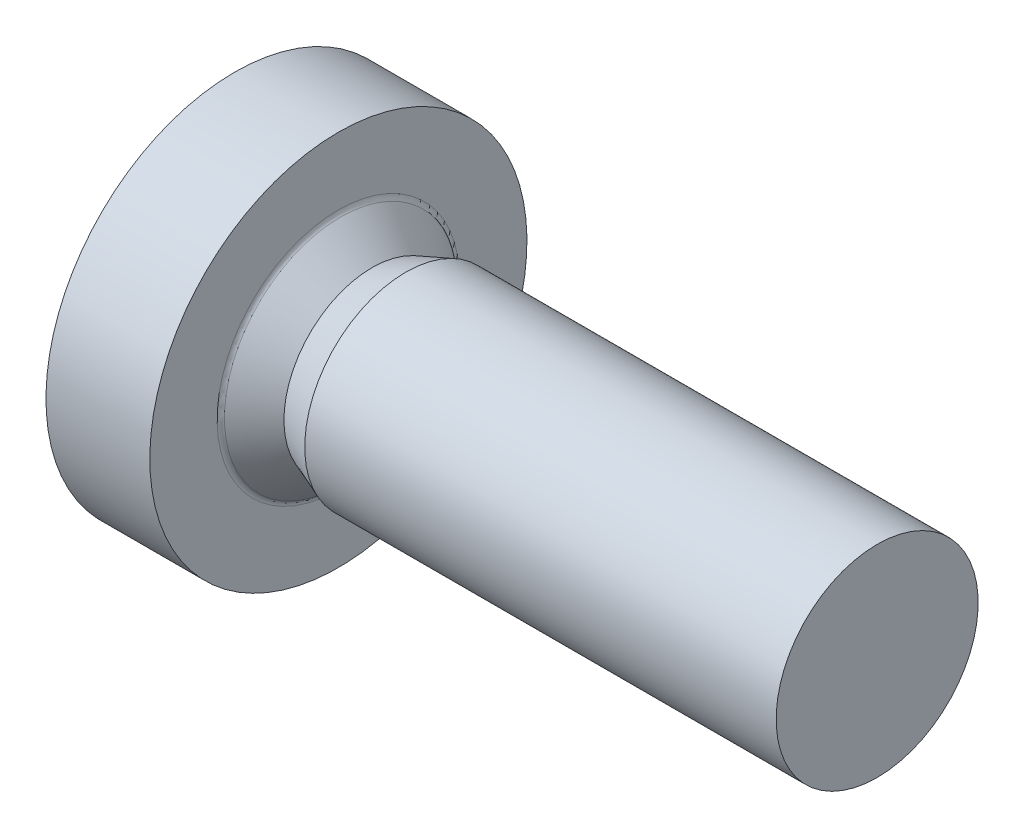
ISO-10303-21;
HEADER;
FILE_DESCRIPTION(('STEP AP214'),'2;1');
FILE_NAME('part.step','',(''),(''),'','','');
FILE_SCHEMA(('AUTOMOTIVE_DESIGN { 1 0 10303 214 1 1 1 1 }'));
ENDSEC;
DATA;
#1=APPLICATION_CONTEXT('core data for automotive mechanical design processes');
#2=APPLICATION_PROTOCOL_DEFINITION('international standard','automotive_design',2000,#1);
#3=PRODUCT_CONTEXT('',#1,'mechanical');
#4=PRODUCT('Part','Part','',(#3));
#5=PRODUCT_RELATED_PRODUCT_CATEGORY('part','',(#4));
#6=PRODUCT_DEFINITION_FORMATION('','',#4);
#7=PRODUCT_DEFINITION_CONTEXT('part definition',#1,'design');
#8=PRODUCT_DEFINITION('design','',#6,#7);
#9=PRODUCT_DEFINITION_SHAPE('','',#8);
#10=(LENGTH_UNIT() NAMED_UNIT(*) SI_UNIT(.MILLI.,.METRE.));
#11=(NAMED_UNIT(*) PLANE_ANGLE_UNIT() SI_UNIT($,.RADIAN.));
#12=(NAMED_UNIT(*) SI_UNIT($,.STERADIAN.) SOLID_ANGLE_UNIT());
#13=UNCERTAINTY_MEASURE_WITH_UNIT(LENGTH_MEASURE(1.E-05),#10,'distance_accuracy_value','');
#14=(GEOMETRIC_REPRESENTATION_CONTEXT(3) GLOBAL_UNCERTAINTY_ASSIGNED_CONTEXT((#13)) GLOBAL_UNIT_ASSIGNED_CONTEXT((#10,
#11,#12)) REPRESENTATION_CONTEXT('',''));
#15=CARTESIAN_POINT('',(0.,0.,0.));
#16=DIRECTION('',(0.,0.,1.));
#17=DIRECTION('',(1.,0.,0.));
#18=AXIS2_PLACEMENT_3D('',#15,#16,#17);
#19=CARTESIAN_POINT('',(8.,0.75,0.));
#20=DIRECTION('',(1.,0.,0.));
#21=DIRECTION('',(0.,1.,0.));
#22=AXIS2_PLACEMENT_3D('',#19,#20,#21);
#23=PLANE('',#22);
#24=CARTESIAN_POINT('',(8.,0.,0.));
#25=DIRECTION('',(1.,0.,0.));
#26=DIRECTION('',(0.,1.,0.));
#27=AXIS2_PLACEMENT_3D('',#24,#25,#26);
#28=CIRCLE('',#27,1.5);
#29=CARTESIAN_POINT('',(8.,1.5,0.));
#30=VERTEX_POINT('',#29);
#31=EDGE_CURVE('E11',#30,#30,#28,.T.);
#32=ORIENTED_EDGE('',*,*,#31,.T.);
#33=EDGE_LOOP('',(#32));
#34=FACE_BOUND('',#33,.T.);
#35=ADVANCED_FACE('F19',(#34),#23,.T.);
#36=CARTESIAN_POINT('',(4.5,0.,0.));
#37=DIRECTION('',(-1.,0.,0.));
#38=DIRECTION('',(0.,1.,0.));
#39=AXIS2_PLACEMENT_3D('',#36,#37,#38);
#40=CYLINDRICAL_SURFACE('',#39,1.5);
#41=CARTESIAN_POINT('',(1.,0.,0.));
#42=DIRECTION('',(1.,0.,0.));
#43=DIRECTION('',(0.,1.,0.));
#44=AXIS2_PLACEMENT_3D('',#41,#42,#43);
#45=CIRCLE('',#44,1.5);
#46=CARTESIAN_POINT('',(1.,1.5,0.));
#47=VERTEX_POINT('',#46);
#48=EDGE_CURVE('E29',#47,#47,#45,.T.);
#49=ORIENTED_EDGE('',*,*,#48,.T.);
#50=EDGE_LOOP('',(#49));
#51=FACE_BOUND('',#50,.T.);
#52=ORIENTED_EDGE('',*,*,#31,.F.);
#53=EDGE_LOOP('',(#52));
#54=FACE_BOUND('',#53,.T.);
#55=ADVANCED_FACE('F431',(#51,#54),#40,.T.);
#56=CARTESIAN_POINT('',(0.75,0.,0.));
#57=DIRECTION('',(1.,0.,0.));
#58=DIRECTION('',(0.,1.,0.));
#59=AXIS2_PLACEMENT_3D('',#56,#57,#58);
#60=CONICAL_SURFACE('',#59,1.404375,0.365329745380517);
#61=CARTESIAN_POINT('',(0.5,0.,0.));
#62=DIRECTION('',(1.,0.,0.));
#63=DIRECTION('',(0.,1.,0.));
#64=AXIS2_PLACEMENT_3D('',#61,#62,#63);
#65=CIRCLE('',#64,1.30875);
#66=CARTESIAN_POINT('',(0.5,1.30875,0.));
#67=VERTEX_POINT('',#66);
#68=EDGE_CURVE('E311',#67,#67,#65,.T.);
#69=ORIENTED_EDGE('',*,*,#68,.T.);
#70=EDGE_LOOP('',(#69));
#71=FACE_BOUND('',#70,.T.);
#72=ORIENTED_EDGE('',*,*,#48,.F.);
#73=EDGE_LOOP('',(#72));
#74=FACE_BOUND('',#73,.T.);
#75=ADVANCED_FACE('F436',(#71,#74),#60,.T.);
#76=CARTESIAN_POINT('',(0.266697090928547,0.,0.));
#77=DIRECTION('',(-1.,0.,0.));
#78=DIRECTION('',(0.,1.,0.));
#79=AXIS2_PLACEMENT_3D('',#76,#77,#78);
#80=CONICAL_SURFACE('',#79,1.51708001042528,0.728911585355214);
#81=CARTESIAN_POINT('',(0.0333941818570946,0.,0.));
#82=DIRECTION('',(1.,0.,0.));
#83=DIRECTION('',(0.,1.,0.));
#84=AXIS2_PLACEMENT_3D('',#81,#82,#83);
#85=CIRCLE('',#84,1.72541002085056);
#86=CARTESIAN_POINT('',(0.0333941818570951,1.72541002085056,0.));
#87=VERTEX_POINT('',#86);
#88=EDGE_CURVE('E313',#87,#87,#85,.T.);
#89=ORIENTED_EDGE('',*,*,#88,.T.);
#90=EDGE_LOOP('',(#89));
#91=FACE_BOUND('',#90,.T.);
#92=ORIENTED_EDGE('',*,*,#68,.F.);
#93=EDGE_LOOP('',(#92));
#94=FACE_BOUND('',#93,.T.);
#95=ADVANCED_FACE('F448',(#91,#94),#80,.T.);
#96=CARTESIAN_POINT('',(0.1,0.,0.));
#97=DIRECTION('',(1.,0.,0.));
#98=DIRECTION('',(0.,0.,-1.));
#99=AXIS2_PLACEMENT_3D('',#96,#97,#98);
#100=TOROIDAL_SURFACE('',#99,1.8,0.1);
#101=CARTESIAN_POINT('',(0.,0.,0.));
#102=DIRECTION('',(1.,0.,0.));
#103=DIRECTION('',(0.,1.,0.));
#104=AXIS2_PLACEMENT_3D('',#101,#102,#103);
#105=CIRCLE('',#104,1.8);
#106=CARTESIAN_POINT('',(0.,1.8,0.));
#107=VERTEX_POINT('',#106);
#108=EDGE_CURVE('E261',#107,#107,#105,.T.);
#109=ORIENTED_EDGE('',*,*,#108,.T.);
#110=EDGE_LOOP('',(#109));
#111=FACE_BOUND('',#110,.T.);
#112=ORIENTED_EDGE('',*,*,#88,.F.);
#113=EDGE_LOOP('',(#112));
#114=FACE_BOUND('',#113,.T.);
#115=ADVANCED_FACE('F444',(#111,#114),#100,.F.);
#116=CARTESIAN_POINT('',(0.,2.3,0.));
#117=DIRECTION('',(1.,0.,0.));
#118=DIRECTION('',(0.,1.,0.));
#119=AXIS2_PLACEMENT_3D('',#116,#117,#118);
#120=PLANE('',#119);
#121=CARTESIAN_POINT('',(0.,0.,0.));
#122=DIRECTION('',(1.,0.,0.));
#123=DIRECTION('',(0.,1.,0.));
#124=AXIS2_PLACEMENT_3D('',#121,#122,#123);
#125=CIRCLE('',#124,2.8);
#126=CARTESIAN_POINT('',(0.,2.8,0.));
#127=VERTEX_POINT('',#126);
#128=EDGE_CURVE('E257',#127,#127,#125,.T.);
#129=ORIENTED_EDGE('',*,*,#128,.T.);
#130=EDGE_LOOP('',(#129));
#131=FACE_BOUND('',#130,.T.);
#132=ORIENTED_EDGE('',*,*,#108,.F.);
#133=EDGE_LOOP('',(#132));
#134=FACE_BOUND('',#133,.T.);
#135=ADVANCED_FACE('F447',(#131,#134),#120,.T.);
#136=CARTESIAN_POINT('',(-0.771231517720798,0.,0.));
#137=DIRECTION('',(-1.,0.,0.));
#138=DIRECTION('',(0.,1.,0.));
#139=AXIS2_PLACEMENT_3D('',#136,#137,#138);
#140=CYLINDRICAL_SURFACE('',#139,2.8);
#141=CARTESIAN_POINT('',(-1.54246303544159,0.,0.));
#142=DIRECTION('',(1.,0.,0.));
#143=DIRECTION('',(0.,1.,0.));
#144=AXIS2_PLACEMENT_3D('',#141,#142,#143);
#145=CIRCLE('',#144,2.8);
#146=CARTESIAN_POINT('',(-1.54246303544159,2.8,0.));
#147=VERTEX_POINT('',#146);
#148=EDGE_CURVE('E255',#147,#147,#145,.T.);
#149=ORIENTED_EDGE('',*,*,#148,.T.);
#150=EDGE_LOOP('',(#149));
#151=FACE_BOUND('',#150,.T.);
#152=ORIENTED_EDGE('',*,*,#128,.F.);
#153=EDGE_LOOP('',(#152));
#154=FACE_BOUND('',#153,.T.);
#155=ADVANCED_FACE('F461',(#151,#154),#140,.T.);
#156=CARTESIAN_POINT('',(2.6,0.,0.));
#157=DIRECTION('',(0.,0.,1.));
#158=DIRECTION('',(1.,0.,0.));
#159=AXIS2_PLACEMENT_3D('',#156,#157,#158);
#160=SPHERICAL_SURFACE('',#159,5.);
#161=ORIENTED_EDGE('',*,*,#148,.F.);
#162=EDGE_LOOP('',(#161));
#163=FACE_BOUND('',#162,.T.);
#164=CARTESIAN_POINT('',(2.6,1.5,0.));
#165=DIRECTION('',(0.,1.,0.));
#166=DIRECTION('',(0.,0.,-1.));
#167=AXIS2_PLACEMENT_3D('',#164,#165,#166);
#168=CIRCLE('',#167,4.76969600708473);
#169=CARTESIAN_POINT('',(-2.16025209416476,1.5,-0.3));
#170=VERTEX_POINT('',#169);
#171=CARTESIAN_POINT('',(-2.16025209416476,1.5,0.3));
#172=VERTEX_POINT('',#171);
#173=EDGE_CURVE('E289',#170,#172,#168,.T.);
#174=ORIENTED_EDGE('',*,*,#173,.T.);
#175=CARTESIAN_POINT('',(2.6,-0.0146530414091956,0.167485029701634));
#176=DIRECTION('',(0.,-0.0871557427476582,0.996194698091746));
#177=DIRECTION('',(0.,0.996194698091746,0.0871557427476581));
#178=AXIS2_PLACEMENT_3D('',#175,#176,#177);
#179=CIRCLE('',#178,4.99717260590459);
#180=CARTESIAN_POINT('',(-2.35893576512593,0.6,0.221260202826669));
#181=VERTEX_POINT('',#180);
#182=EDGE_CURVE('E226',#172,#181,#179,.T.);
#183=ORIENTED_EDGE('',*,*,#182,.T.);
#184=CARTESIAN_POINT('',(2.6,0.245808478247197,0.425752773255334));
#185=DIRECTION('',(0.,0.5,0.866025403784438));
#186=DIRECTION('',(0.,0.866025403784438,-0.5));
#187=AXIS2_PLACEMENT_3D('',#184,#185,#186);
#188=CIRCLE('',#187,4.97577258002083);
#189=CARTESIAN_POINT('',(-2.374028589137,0.359888590016273,0.359888590016274));
#190=VERTEX_POINT('',#189);
#191=EDGE_CURVE('E285',#181,#190,#188,.T.);
#192=ORIENTED_EDGE('',*,*,#191,.T.);
#193=CARTESIAN_POINT('',(2.6,0.425752773255333,0.245808478247197));
#194=DIRECTION('',(0.,0.866025403784439,0.5));
#195=DIRECTION('',(0.,0.5,-0.866025403784439));
#196=AXIS2_PLACEMENT_3D('',#193,#194,#195);
#197=CIRCLE('',#196,4.97577258002083);
#198=CARTESIAN_POINT('',(-2.35893576512593,0.221260202826669,0.6));
#199=VERTEX_POINT('',#198);
#200=EDGE_CURVE('E224',#190,#199,#197,.T.);
#201=ORIENTED_EDGE('',*,*,#200,.T.);
#202=CARTESIAN_POINT('',(2.6,0.167485029701634,-0.0146530414091956));
#203=DIRECTION('',(0.,0.996194698091746,-0.0871557427476583));
#204=DIRECTION('',(0.,-0.0871557427476583,-0.996194698091746));
#205=AXIS2_PLACEMENT_3D('',#202,#203,#204);
#206=CIRCLE('',#205,4.99717260590459);
#207=CARTESIAN_POINT('',(-2.16025209416476,0.3,1.5));
#208=VERTEX_POINT('',#207);
#209=EDGE_CURVE('E246',#199,#208,#206,.T.);
#210=ORIENTED_EDGE('',*,*,#209,.T.);
#211=CARTESIAN_POINT('',(2.6,0.,1.5));
#212=DIRECTION('',(0.,0.,1.));
#213=DIRECTION('',(0.,1.,0.));
#214=AXIS2_PLACEMENT_3D('',#211,#212,#213);
#215=CIRCLE('',#214,4.76969600708473);
#216=CARTESIAN_POINT('',(-2.16025209416476,-0.3,1.5));
#217=VERTEX_POINT('',#216);
#218=EDGE_CURVE('E242',#208,#217,#215,.T.);
#219=ORIENTED_EDGE('',*,*,#218,.T.);
#220=CARTESIAN_POINT('',(2.6,-0.167485029701634,-0.0146530414091956));
#221=DIRECTION('',(0.,-0.996194698091746,-0.0871557427476581));
#222=DIRECTION('',(0.,-0.0871557427476581,0.996194698091746));
#223=AXIS2_PLACEMENT_3D('',#220,#221,#222);
#224=CIRCLE('',#223,4.99717260590459);
#225=CARTESIAN_POINT('',(-2.35893576512593,-0.221260202826669,0.6));
#226=VERTEX_POINT('',#225);
#227=EDGE_CURVE('E189',#217,#226,#224,.T.);
#228=ORIENTED_EDGE('',*,*,#227,.T.);
#229=CARTESIAN_POINT('',(2.6,-0.425752773255333,0.245808478247197));
#230=DIRECTION('',(0.,-0.866025403784439,0.5));
#231=DIRECTION('',(0.,0.5,0.866025403784439));
#232=AXIS2_PLACEMENT_3D('',#229,#230,#231);
#233=CIRCLE('',#232,4.97577258002083);
#234=CARTESIAN_POINT('',(-2.374028589137,-0.359888590016273,0.359888590016274));
#235=VERTEX_POINT('',#234);
#236=EDGE_CURVE('E199',#226,#235,#233,.T.);
#237=ORIENTED_EDGE('',*,*,#236,.T.);
#238=CARTESIAN_POINT('',(2.6,-0.245808478247197,0.425752773255334));
#239=DIRECTION('',(0.,-0.5,0.866025403784439));
#240=DIRECTION('',(0.,0.866025403784439,0.5));
#241=AXIS2_PLACEMENT_3D('',#238,#239,#240);
#242=CIRCLE('',#241,4.97577258002083);
#243=CARTESIAN_POINT('',(-2.35893576512593,-0.6,0.221260202826669));
#244=VERTEX_POINT('',#243);
#245=EDGE_CURVE('E202',#235,#244,#242,.T.);
#246=ORIENTED_EDGE('',*,*,#245,.T.);
#247=CARTESIAN_POINT('',(2.6,0.0146530414091956,0.167485029701634));
#248=DIRECTION('',(0.,0.0871557427476581,0.996194698091746));
#249=DIRECTION('',(0.,0.996194698091746,-0.0871557427476581));
#250=AXIS2_PLACEMENT_3D('',#247,#248,#249);
#251=CIRCLE('',#250,4.99717260590459);
#252=CARTESIAN_POINT('',(-2.16025209416476,-1.5,0.3));
#253=VERTEX_POINT('',#252);
#254=EDGE_CURVE('E275',#244,#253,#251,.T.);
#255=ORIENTED_EDGE('',*,*,#254,.T.);
#256=CARTESIAN_POINT('',(2.6,-1.5,0.));
#257=DIRECTION('',(0.,-1.,0.));
#258=DIRECTION('',(0.,0.,1.));
#259=AXIS2_PLACEMENT_3D('',#256,#257,#258);
#260=CIRCLE('',#259,4.76969600708473);
#261=CARTESIAN_POINT('',(-2.16025209416476,-1.5,-0.3));
#262=VERTEX_POINT('',#261);
#263=EDGE_CURVE('E310',#253,#262,#260,.T.);
#264=ORIENTED_EDGE('',*,*,#263,.T.);
#265=CARTESIAN_POINT('',(2.6,0.0146530414091956,-0.167485029701634));
#266=DIRECTION('',(0.,0.087155742747658,-0.996194698091746));
#267=DIRECTION('',(0.,-0.996194698091746,-0.087155742747658));
#268=AXIS2_PLACEMENT_3D('',#265,#266,#267);
#269=CIRCLE('',#268,4.99717260590459);
#270=CARTESIAN_POINT('',(-2.35893576512593,-0.6,-0.221260202826669));
#271=VERTEX_POINT('',#270);
#272=EDGE_CURVE('E209',#262,#271,#269,.T.);
#273=ORIENTED_EDGE('',*,*,#272,.T.);
#274=CARTESIAN_POINT('',(2.6,-0.245808478247196,-0.425752773255333));
#275=DIRECTION('',(0.,-0.5,-0.866025403784439));
#276=DIRECTION('',(0.,-0.866025403784439,0.5));
#277=AXIS2_PLACEMENT_3D('',#274,#275,#276);
#278=CIRCLE('',#277,4.97577258002083);
#279=CARTESIAN_POINT('',(-2.374028589137,-0.359888590016273,-0.359888590016273));
#280=VERTEX_POINT('',#279);
#281=EDGE_CURVE('E236',#271,#280,#278,.T.);
#282=ORIENTED_EDGE('',*,*,#281,.T.);
#283=CARTESIAN_POINT('',(2.6,-0.425752773255333,-0.245808478247196));
#284=DIRECTION('',(0.,-0.866025403784439,-0.5));
#285=DIRECTION('',(0.,-0.5,0.866025403784439));
#286=AXIS2_PLACEMENT_3D('',#283,#284,#285);
#287=CIRCLE('',#286,4.97577258002083);
#288=CARTESIAN_POINT('',(-2.35893576512593,-0.221260202826669,-0.6));
#289=VERTEX_POINT('',#288);
#290=EDGE_CURVE('E269',#280,#289,#287,.T.);
#291=ORIENTED_EDGE('',*,*,#290,.T.);
#292=CARTESIAN_POINT('',(2.6,-0.167485029701634,0.0146530414091956));
#293=DIRECTION('',(0.,-0.996194698091746,0.0871557427476582));
#294=DIRECTION('',(0.,0.0871557427476582,0.996194698091746));
#295=AXIS2_PLACEMENT_3D('',#292,#293,#294);
#296=CIRCLE('',#295,4.99717260590459);
#297=CARTESIAN_POINT('',(-2.16025209416476,-0.3,-1.5));
#298=VERTEX_POINT('',#297);
#299=EDGE_CURVE('E253',#289,#298,#296,.T.);
#300=ORIENTED_EDGE('',*,*,#299,.T.);
#301=CARTESIAN_POINT('',(2.6,0.,-1.5));
#302=DIRECTION('',(0.,0.,-1.));
#303=DIRECTION('',(0.,-1.,0.));
#304=AXIS2_PLACEMENT_3D('',#301,#302,#303);
#305=CIRCLE('',#304,4.76969600708473);
#306=CARTESIAN_POINT('',(-2.16025209416476,0.3,-1.5));
#307=VERTEX_POINT('',#306);
#308=EDGE_CURVE('E321',#298,#307,#305,.T.);
#309=ORIENTED_EDGE('',*,*,#308,.T.);
#310=CARTESIAN_POINT('',(2.6,0.167485029701634,0.0146530414091956));
#311=DIRECTION('',(0.,0.996194698091746,0.0871557427476582));
#312=DIRECTION('',(0.,0.0871557427476582,-0.996194698091746));
#313=AXIS2_PLACEMENT_3D('',#310,#311,#312);
#314=CIRCLE('',#313,4.99717260590459);
#315=CARTESIAN_POINT('',(-2.35893576512593,0.221260202826669,-0.6));
#316=VERTEX_POINT('',#315);
#317=EDGE_CURVE('E214',#307,#316,#314,.T.);
#318=ORIENTED_EDGE('',*,*,#317,.T.);
#319=CARTESIAN_POINT('',(2.6,0.425752773255333,-0.245808478247196));
#320=DIRECTION('',(0.,0.866025403784439,-0.5));
#321=DIRECTION('',(0.,-0.5,-0.866025403784439));
#322=AXIS2_PLACEMENT_3D('',#319,#320,#321);
#323=CIRCLE('',#322,4.97577258002083);
#324=CARTESIAN_POINT('',(-2.374028589137,0.359888590016273,-0.359888590016274));
#325=VERTEX_POINT('',#324);
#326=EDGE_CURVE('E109',#316,#325,#323,.T.);
#327=ORIENTED_EDGE('',*,*,#326,.T.);
#328=CARTESIAN_POINT('',(2.6,0.245808478247196,-0.425752773255333));
#329=DIRECTION('',(0.,0.5,-0.866025403784439));
#330=DIRECTION('',(0.,-0.866025403784439,-0.5));
#331=AXIS2_PLACEMENT_3D('',#328,#329,#330);
#332=CIRCLE('',#331,4.97577258002083);
#333=CARTESIAN_POINT('',(-2.35893576512593,0.6,-0.221260202826669));
#334=VERTEX_POINT('',#333);
#335=EDGE_CURVE('E207',#325,#334,#332,.T.);
#336=ORIENTED_EDGE('',*,*,#335,.T.);
#337=CARTESIAN_POINT('',(2.6,-0.0146530414091956,-0.167485029701633));
#338=DIRECTION('',(0.,-0.0871557427476582,-0.996194698091746));
#339=DIRECTION('',(0.,-0.996194698091746,0.0871557427476582));
#340=AXIS2_PLACEMENT_3D('',#337,#338,#339);
#341=CIRCLE('',#340,4.99717260590459);
#342=EDGE_CURVE('E304',#334,#170,#341,.T.);
#343=ORIENTED_EDGE('',*,*,#342,.T.);
#344=EDGE_LOOP('',(#174,#183,#192,#201,#210,#219,#228,#237,#246,#255,#264,#273,#282,#291,#300,
#309,#318,#327,#336,#343));
#345=FACE_BOUND('',#344,.T.);
#346=ADVANCED_FACE('F352',(#163,#345),#160,.T.);
#347=CARTESIAN_POINT('',(-1.2,0.,0.));
#348=DIRECTION('',(1.,0.,0.));
#349=DIRECTION('',(0.,0.,-1.));
#350=AXIS2_PLACEMENT_3D('',#347,#348,#349);
#351=PLANE('',#350);
#352=DIRECTION('',(0.,0.,-1.));
#353=VECTOR('',#352,1.);
#354=CARTESIAN_POINT('',(-1.2,1.5,-0.3));
#355=LINE('',#354,#353);
#356=CARTESIAN_POINT('',(-1.2,1.5,0.3));
#357=VERTEX_POINT('',#356);
#358=CARTESIAN_POINT('',(-1.2,1.5,-0.3));
#359=VERTEX_POINT('',#358);
#360=EDGE_CURVE('E276',#357,#359,#355,.T.);
#361=ORIENTED_EDGE('',*,*,#360,.T.);
#362=DIRECTION('',(0.,-0.996194698091746,0.0871557427476582));
#363=VECTOR('',#362,1.);
#364=CARTESIAN_POINT('',(-1.2,1.5,-0.3));
#365=LINE('',#364,#363);
#366=CARTESIAN_POINT('',(-1.2,0.6,-0.221260202826669));
#367=VERTEX_POINT('',#366);
#368=EDGE_CURVE('E293',#359,#367,#365,.T.);
#369=ORIENTED_EDGE('',*,*,#368,.T.);
#370=DIRECTION('',(0.,-0.866025403784439,-0.5));
#371=VECTOR('',#370,1.);
#372=CARTESIAN_POINT('',(-1.2,0.6,-0.221260202826669));
#373=LINE('',#372,#371);
#374=CARTESIAN_POINT('',(-1.2,0.359888590016273,-0.359888590016273));
#375=VERTEX_POINT('',#374);
#376=EDGE_CURVE('E305',#367,#375,#373,.T.);
#377=ORIENTED_EDGE('',*,*,#376,.T.);
#378=DIRECTION('',(0.,-0.5,-0.866025403784439));
#379=VECTOR('',#378,1.);
#380=CARTESIAN_POINT('',(-1.2,0.221260202826669,-0.6));
#381=LINE('',#380,#379);
#382=CARTESIAN_POINT('',(-1.2,0.221260202826669,-0.6));
#383=VERTEX_POINT('',#382);
#384=EDGE_CURVE('E99',#375,#383,#381,.T.);
#385=ORIENTED_EDGE('',*,*,#384,.T.);
#386=DIRECTION('',(0.,0.0871557427476582,-0.996194698091746));
#387=VECTOR('',#386,1.);
#388=CARTESIAN_POINT('',(-1.2,0.3,-1.5));
#389=LINE('',#388,#387);
#390=CARTESIAN_POINT('',(-1.2,0.3,-1.5));
#391=VERTEX_POINT('',#390);
#392=EDGE_CURVE('E217',#383,#391,#389,.T.);
#393=ORIENTED_EDGE('',*,*,#392,.T.);
#394=DIRECTION('',(0.,-1.,0.));
#395=VECTOR('',#394,1.);
#396=CARTESIAN_POINT('',(-1.2,-0.3,-1.5));
#397=LINE('',#396,#395);
#398=CARTESIAN_POINT('',(-1.2,-0.3,-1.5));
#399=VERTEX_POINT('',#398);
#400=EDGE_CURVE('E232',#391,#399,#397,.T.);
#401=ORIENTED_EDGE('',*,*,#400,.T.);
#402=DIRECTION('',(0.,0.0871557427476582,0.996194698091746));
#403=VECTOR('',#402,1.);
#404=CARTESIAN_POINT('',(-1.2,-0.3,-1.5));
#405=LINE('',#404,#403);
#406=CARTESIAN_POINT('',(-1.2,-0.221260202826669,-0.6));
#407=VERTEX_POINT('',#406);
#408=EDGE_CURVE('E297',#399,#407,#405,.T.);
#409=ORIENTED_EDGE('',*,*,#408,.T.);
#410=DIRECTION('',(0.,-0.5,0.866025403784439));
#411=VECTOR('',#410,1.);
#412=CARTESIAN_POINT('',(-1.2,-0.221260202826669,-0.6));
#413=LINE('',#412,#411);
#414=CARTESIAN_POINT('',(-1.2,-0.359888590016273,-0.359888590016273));
#415=VERTEX_POINT('',#414);
#416=EDGE_CURVE('E254',#407,#415,#413,.T.);
#417=ORIENTED_EDGE('',*,*,#416,.T.);
#418=DIRECTION('',(0.,-0.866025403784439,0.5));
#419=VECTOR('',#418,1.);
#420=CARTESIAN_POINT('',(-1.2,-0.6,-0.221260202826669));
#421=LINE('',#420,#419);
#422=CARTESIAN_POINT('',(-1.2,-0.6,-0.221260202826669));
#423=VERTEX_POINT('',#422);
#424=EDGE_CURVE('E270',#415,#423,#421,.T.);
#425=ORIENTED_EDGE('',*,*,#424,.T.);
#426=DIRECTION('',(0.,-0.996194698091746,-0.087155742747658));
#427=VECTOR('',#426,1.);
#428=CARTESIAN_POINT('',(-1.2,-1.5,-0.3));
#429=LINE('',#428,#427);
#430=CARTESIAN_POINT('',(-1.2,-1.5,-0.3));
#431=VERTEX_POINT('',#430);
#432=EDGE_CURVE('E212',#423,#431,#429,.T.);
#433=ORIENTED_EDGE('',*,*,#432,.T.);
#434=DIRECTION('',(0.,0.,1.));
#435=VECTOR('',#434,1.);
#436=CARTESIAN_POINT('',(-1.2,-1.5,0.3));
#437=LINE('',#436,#435);
#438=CARTESIAN_POINT('',(-1.2,-1.5,0.3));
#439=VERTEX_POINT('',#438);
#440=EDGE_CURVE('E309',#431,#439,#437,.T.);
#441=ORIENTED_EDGE('',*,*,#440,.T.);
#442=DIRECTION('',(0.,0.996194698091746,-0.0871557427476581));
#443=VECTOR('',#442,1.);
#444=CARTESIAN_POINT('',(-1.2,-1.5,0.3));
#445=LINE('',#444,#443);
#446=CARTESIAN_POINT('',(-1.2,-0.6,0.221260202826669));
#447=VERTEX_POINT('',#446);
#448=EDGE_CURVE('E195',#439,#447,#445,.T.);
#449=ORIENTED_EDGE('',*,*,#448,.T.);
#450=DIRECTION('',(0.,0.866025403784439,0.5));
#451=VECTOR('',#450,1.);
#452=CARTESIAN_POINT('',(-1.2,-0.6,0.221260202826669));
#453=LINE('',#452,#451);
#454=CARTESIAN_POINT('',(-1.2,-0.359888590016273,0.359888590016274));
#455=VERTEX_POINT('',#454);
#456=EDGE_CURVE('E192',#447,#455,#453,.T.);
#457=ORIENTED_EDGE('',*,*,#456,.T.);
#458=DIRECTION('',(0.,0.5,0.866025403784439));
#459=VECTOR('',#458,1.);
#460=CARTESIAN_POINT('',(-1.2,-0.221260202826669,0.6));
#461=LINE('',#460,#459);
#462=CARTESIAN_POINT('',(-1.2,-0.221260202826669,0.6));
#463=VERTEX_POINT('',#462);
#464=EDGE_CURVE('E179',#455,#463,#461,.T.);
#465=ORIENTED_EDGE('',*,*,#464,.T.);
#466=DIRECTION('',(0.,-0.0871557427476581,0.996194698091746));
#467=VECTOR('',#466,1.);
#468=CARTESIAN_POINT('',(-1.2,-0.3,1.5));
#469=LINE('',#468,#467);
#470=CARTESIAN_POINT('',(-1.2,-0.3,1.5));
#471=VERTEX_POINT('',#470);
#472=EDGE_CURVE('E240',#463,#471,#469,.T.);
#473=ORIENTED_EDGE('',*,*,#472,.T.);
#474=DIRECTION('',(0.,1.,0.));
#475=VECTOR('',#474,1.);
#476=CARTESIAN_POINT('',(-1.2,0.3,1.5));
#477=LINE('',#476,#475);
#478=CARTESIAN_POINT('',(-1.2,0.3,1.5));
#479=VERTEX_POINT('',#478);
#480=EDGE_CURVE('E243',#471,#479,#477,.T.);
#481=ORIENTED_EDGE('',*,*,#480,.T.);
#482=DIRECTION('',(0.,-0.0871557427476583,-0.996194698091746));
#483=VECTOR('',#482,1.);
#484=CARTESIAN_POINT('',(-1.2,0.3,1.5));
#485=LINE('',#484,#483);
#486=CARTESIAN_POINT('',(-1.2,0.221260202826669,0.6));
#487=VERTEX_POINT('',#486);
#488=EDGE_CURVE('E221',#479,#487,#485,.T.);
#489=ORIENTED_EDGE('',*,*,#488,.T.);
#490=DIRECTION('',(0.,0.5,-0.866025403784439));
#491=VECTOR('',#490,1.);
#492=CARTESIAN_POINT('',(-1.2,0.221260202826669,0.6));
#493=LINE('',#492,#491);
#494=CARTESIAN_POINT('',(-1.2,0.359888590016273,0.359888590016274));
#495=VERTEX_POINT('',#494);
#496=EDGE_CURVE('E294',#487,#495,#493,.T.);
#497=ORIENTED_EDGE('',*,*,#496,.T.);
#498=DIRECTION('',(0.,0.866025403784438,-0.5));
#499=VECTOR('',#498,1.);
#500=CARTESIAN_POINT('',(-1.2,0.6,0.221260202826669));
#501=LINE('',#500,#499);
#502=CARTESIAN_POINT('',(-1.2,0.6,0.221260202826669));
#503=VERTEX_POINT('',#502);
#504=EDGE_CURVE('E229',#495,#503,#501,.T.);
#505=ORIENTED_EDGE('',*,*,#504,.T.);
#506=DIRECTION('',(0.,0.996194698091746,0.0871557427476582));
#507=VECTOR('',#506,1.);
#508=CARTESIAN_POINT('',(-1.2,1.5,0.3));
#509=LINE('',#508,#507);
#510=EDGE_CURVE('E228',#503,#357,#509,.T.);
#511=ORIENTED_EDGE('',*,*,#510,.T.);
#512=EDGE_LOOP('',(#361,#369,#377,#385,#393,#401,#409,#417,#425,#433,#441,#449,#457,#465,#473,
#481,#489,#497,#505,#511));
#513=FACE_BOUND('',#512,.T.);
#514=ADVANCED_FACE('F193',(#513),#351,.F.);
#515=CARTESIAN_POINT('',(-2.64,1.05,0.260630101413334));
#516=DIRECTION('',(0.,-0.0871557427476581,0.996194698091746));
#517=DIRECTION('',(0.,-0.996194698091746,-0.0871557427476582));
#518=AXIS2_PLACEMENT_3D('',#515,#516,#517);
#519=PLANE('',#518);
#520=ORIENTED_EDGE('',*,*,#182,.F.);
#521=DIRECTION('',(1.,0.,0.));
#522=VECTOR('',#521,1.);
#523=CARTESIAN_POINT('',(-2.64,1.5,0.3));
#524=LINE('',#523,#522);
#525=EDGE_CURVE('E272',#172,#357,#524,.T.);
#526=ORIENTED_EDGE('',*,*,#525,.T.);
#527=ORIENTED_EDGE('',*,*,#510,.F.);
#528=DIRECTION('',(1.,0.,0.));
#529=VECTOR('',#528,1.);
#530=CARTESIAN_POINT('',(-2.64,0.6,0.221260202826669));
#531=LINE('',#530,#529);
#532=EDGE_CURVE('E265',#181,#503,#531,.T.);
#533=ORIENTED_EDGE('',*,*,#532,.F.);
#534=EDGE_LOOP('',(#520,#526,#527,#533));
#535=FACE_BOUND('',#534,.T.);
#536=ADVANCED_FACE('F418',(#535),#519,.F.);
#537=CARTESIAN_POINT('',(-2.64,0.479944295008137,0.290574396421471));
#538=DIRECTION('',(0.,0.5,0.866025403784438));
#539=DIRECTION('',(0.,-0.866025403784438,0.5));
#540=AXIS2_PLACEMENT_3D('',#537,#538,#539);
#541=PLANE('',#540);
#542=ORIENTED_EDGE('',*,*,#191,.F.);
#543=ORIENTED_EDGE('',*,*,#532,.T.);
#544=ORIENTED_EDGE('',*,*,#504,.F.);
#545=DIRECTION('',(1.,0.,0.));
#546=VECTOR('',#545,1.);
#547=CARTESIAN_POINT('',(-2.64,0.359888590016273,0.359888590016273));
#548=LINE('',#547,#546);
#549=EDGE_CURVE('E249',#190,#495,#548,.T.);
#550=ORIENTED_EDGE('',*,*,#549,.F.);
#551=EDGE_LOOP('',(#542,#543,#544,#550));
#552=FACE_BOUND('',#551,.T.);
#553=ADVANCED_FACE('F419',(#552),#541,.F.);
#554=CARTESIAN_POINT('',(-2.64,0.290574396421471,0.479944295008137));
#555=DIRECTION('',(0.,0.866025403784439,0.5));
#556=DIRECTION('',(0.,-0.5,0.866025403784439));
#557=AXIS2_PLACEMENT_3D('',#554,#555,#556);
#558=PLANE('',#557);
#559=ORIENTED_EDGE('',*,*,#200,.F.);
#560=ORIENTED_EDGE('',*,*,#549,.T.);
#561=ORIENTED_EDGE('',*,*,#496,.F.);
#562=DIRECTION('',(1.,0.,0.));
#563=VECTOR('',#562,1.);
#564=CARTESIAN_POINT('',(-2.64,0.221260202826669,0.6));
#565=LINE('',#564,#563);
#566=EDGE_CURVE('E225',#199,#487,#565,.T.);
#567=ORIENTED_EDGE('',*,*,#566,.F.);
#568=EDGE_LOOP('',(#559,#560,#561,#567));
#569=FACE_BOUND('',#568,.T.);
#570=ADVANCED_FACE('F402',(#569),#558,.F.);
#571=CARTESIAN_POINT('',(-2.64,0.260630101413335,1.05));
#572=DIRECTION('',(0.,0.996194698091746,-0.0871557427476583));
#573=DIRECTION('',(0.,0.0871557427476583,0.996194698091746));
#574=AXIS2_PLACEMENT_3D('',#571,#572,#573);
#575=PLANE('',#574);
#576=ORIENTED_EDGE('',*,*,#209,.F.);
#577=ORIENTED_EDGE('',*,*,#566,.T.);
#578=ORIENTED_EDGE('',*,*,#488,.F.);
#579=DIRECTION('',(1.,0.,0.));
#580=VECTOR('',#579,1.);
#581=CARTESIAN_POINT('',(-2.64,0.3,1.5));
#582=LINE('',#581,#580);
#583=EDGE_CURVE('E247',#208,#479,#582,.T.);
#584=ORIENTED_EDGE('',*,*,#583,.F.);
#585=EDGE_LOOP('',(#576,#577,#578,#584));
#586=FACE_BOUND('',#585,.T.);
#587=ADVANCED_FACE('F397',(#586),#575,.F.);
#588=CARTESIAN_POINT('',(-2.64,0.,1.5));
#589=DIRECTION('',(0.,0.,1.));
#590=DIRECTION('',(0.,-1.,0.));
#591=AXIS2_PLACEMENT_3D('',#588,#589,#590);
#592=PLANE('',#591);
#593=ORIENTED_EDGE('',*,*,#218,.F.);
#594=ORIENTED_EDGE('',*,*,#583,.T.);
#595=ORIENTED_EDGE('',*,*,#480,.F.);
#596=DIRECTION('',(1.,0.,0.));
#597=VECTOR('',#596,1.);
#598=CARTESIAN_POINT('',(-2.64,-0.3,1.5));
#599=LINE('',#598,#597);
#600=EDGE_CURVE('E220',#217,#471,#599,.T.);
#601=ORIENTED_EDGE('',*,*,#600,.F.);
#602=EDGE_LOOP('',(#593,#594,#595,#601));
#603=FACE_BOUND('',#602,.T.);
#604=ADVANCED_FACE('F21',(#603),#592,.F.);
#605=CARTESIAN_POINT('',(-2.64,-0.260630101413334,1.05));
#606=DIRECTION('',(0.,-0.996194698091746,-0.0871557427476581));
#607=DIRECTION('',(0.,0.0871557427476581,-0.996194698091746));
#608=AXIS2_PLACEMENT_3D('',#605,#606,#607);
#609=PLANE('',#608);
#610=ORIENTED_EDGE('',*,*,#227,.F.);
#611=ORIENTED_EDGE('',*,*,#600,.T.);
#612=ORIENTED_EDGE('',*,*,#472,.F.);
#613=DIRECTION('',(1.,0.,0.));
#614=VECTOR('',#613,1.);
#615=CARTESIAN_POINT('',(-2.64,-0.221260202826669,0.6));
#616=LINE('',#615,#614);
#617=EDGE_CURVE('E187',#226,#463,#616,.T.);
#618=ORIENTED_EDGE('',*,*,#617,.F.);
#619=EDGE_LOOP('',(#610,#611,#612,#618));
#620=FACE_BOUND('',#619,.T.);
#621=ADVANCED_FACE('F394',(#620),#609,.F.);
#622=CARTESIAN_POINT('',(-2.64,-0.290574396421471,0.479944295008137));
#623=DIRECTION('',(0.,-0.866025403784439,0.5));
#624=DIRECTION('',(0.,-0.5,-0.866025403784439));
#625=AXIS2_PLACEMENT_3D('',#622,#623,#624);
#626=PLANE('',#625);
#627=ORIENTED_EDGE('',*,*,#236,.F.);
#628=ORIENTED_EDGE('',*,*,#617,.T.);
#629=ORIENTED_EDGE('',*,*,#464,.F.);
#630=DIRECTION('',(1.,0.,0.));
#631=VECTOR('',#630,1.);
#632=CARTESIAN_POINT('',(-2.64,-0.359888590016273,0.359888590016274));
#633=LINE('',#632,#631);
#634=EDGE_CURVE('E184',#235,#455,#633,.T.);
#635=ORIENTED_EDGE('',*,*,#634,.F.);
#636=EDGE_LOOP('',(#627,#628,#629,#635));
#637=FACE_BOUND('',#636,.T.);
#638=ADVANCED_FACE('F182',(#637),#626,.F.);
#639=CARTESIAN_POINT('',(-2.64,-0.479944295008137,0.290574396421471));
#640=DIRECTION('',(0.,-0.5,0.866025403784439));
#641=DIRECTION('',(0.,-0.866025403784439,-0.5));
#642=AXIS2_PLACEMENT_3D('',#639,#640,#641);
#643=PLANE('',#642);
#644=ORIENTED_EDGE('',*,*,#245,.F.);
#645=ORIENTED_EDGE('',*,*,#634,.T.);
#646=ORIENTED_EDGE('',*,*,#456,.F.);
#647=DIRECTION('',(1.,0.,0.));
#648=VECTOR('',#647,1.);
#649=CARTESIAN_POINT('',(-2.64,-0.6,0.221260202826669));
#650=LINE('',#649,#648);
#651=EDGE_CURVE('E23',#244,#447,#650,.T.);
#652=ORIENTED_EDGE('',*,*,#651,.F.);
#653=EDGE_LOOP('',(#644,#645,#646,#652));
#654=FACE_BOUND('',#653,.T.);
#655=ADVANCED_FACE('F201',(#654),#643,.F.);
#656=CARTESIAN_POINT('',(-2.64,-1.05,0.260630101413335));
#657=DIRECTION('',(0.,0.0871557427476581,0.996194698091746));
#658=DIRECTION('',(0.,-0.996194698091746,0.0871557427476581));
#659=AXIS2_PLACEMENT_3D('',#656,#657,#658);
#660=PLANE('',#659);
#661=ORIENTED_EDGE('',*,*,#254,.F.);
#662=ORIENTED_EDGE('',*,*,#651,.T.);
#663=ORIENTED_EDGE('',*,*,#448,.F.);
#664=DIRECTION('',(1.,0.,0.));
#665=VECTOR('',#664,1.);
#666=CARTESIAN_POINT('',(-2.64,-1.5,0.3));
#667=LINE('',#666,#665);
#668=EDGE_CURVE('E306',#253,#439,#667,.T.);
#669=ORIENTED_EDGE('',*,*,#668,.F.);
#670=EDGE_LOOP('',(#661,#662,#663,#669));
#671=FACE_BOUND('',#670,.T.);
#672=ADVANCED_FACE('F389',(#671),#660,.F.);
#673=CARTESIAN_POINT('',(-2.64,1.5,0.));
#674=DIRECTION('',(0.,1.,0.));
#675=DIRECTION('',(0.,0.,1.));
#676=AXIS2_PLACEMENT_3D('',#673,#674,#675);
#677=PLANE('',#676);
#678=ORIENTED_EDGE('',*,*,#173,.F.);
#679=DIRECTION('',(1.,0.,0.));
#680=VECTOR('',#679,1.);
#681=CARTESIAN_POINT('',(-2.64,1.5,-0.3));
#682=LINE('',#681,#680);
#683=EDGE_CURVE('E290',#170,#359,#682,.T.);
#684=ORIENTED_EDGE('',*,*,#683,.T.);
#685=ORIENTED_EDGE('',*,*,#360,.F.);
#686=ORIENTED_EDGE('',*,*,#525,.F.);
#687=EDGE_LOOP('',(#678,#684,#685,#686));
#688=FACE_BOUND('',#687,.T.);
#689=ADVANCED_FACE('F412',(#688),#677,.F.);
#690=CARTESIAN_POINT('',(-2.64,1.05,-0.260630101413335));
#691=DIRECTION('',(0.,-0.0871557427476582,-0.996194698091746));
#692=DIRECTION('',(0.,0.996194698091746,-0.0871557427476582));
#693=AXIS2_PLACEMENT_3D('',#690,#691,#692);
#694=PLANE('',#693);
#695=ORIENTED_EDGE('',*,*,#342,.F.);
#696=DIRECTION('',(1.,0.,0.));
#697=VECTOR('',#696,1.);
#698=CARTESIAN_POINT('',(-2.64,0.6,-0.221260202826669));
#699=LINE('',#698,#697);
#700=EDGE_CURVE('E301',#334,#367,#699,.T.);
#701=ORIENTED_EDGE('',*,*,#700,.T.);
#702=ORIENTED_EDGE('',*,*,#368,.F.);
#703=ORIENTED_EDGE('',*,*,#683,.F.);
#704=EDGE_LOOP('',(#695,#701,#702,#703));
#705=FACE_BOUND('',#704,.T.);
#706=ADVANCED_FACE('F416',(#705),#694,.F.);
#707=CARTESIAN_POINT('',(-2.64,0.479944295008137,-0.290574396421471));
#708=DIRECTION('',(0.,0.5,-0.866025403784439));
#709=DIRECTION('',(0.,0.866025403784439,0.5));
#710=AXIS2_PLACEMENT_3D('',#707,#708,#709);
#711=PLANE('',#710);
#712=ORIENTED_EDGE('',*,*,#335,.F.);
#713=DIRECTION('',(1.,0.,0.));
#714=VECTOR('',#713,1.);
#715=CARTESIAN_POINT('',(-2.64,0.359888590016273,-0.359888590016274));
#716=LINE('',#715,#714);
#717=EDGE_CURVE('E278',#325,#375,#716,.T.);
#718=ORIENTED_EDGE('',*,*,#717,.T.);
#719=ORIENTED_EDGE('',*,*,#376,.F.);
#720=ORIENTED_EDGE('',*,*,#700,.F.);
#721=EDGE_LOOP('',(#712,#718,#719,#720));
#722=FACE_BOUND('',#721,.T.);
#723=ADVANCED_FACE('F354',(#722),#711,.F.);
#724=CARTESIAN_POINT('',(-2.64,0.290574396421471,-0.479944295008137));
#725=DIRECTION('',(0.,0.866025403784439,-0.5));
#726=DIRECTION('',(0.,0.5,0.866025403784439));
#727=AXIS2_PLACEMENT_3D('',#724,#725,#726);
#728=PLANE('',#727);
#729=ORIENTED_EDGE('',*,*,#326,.F.);
#730=DIRECTION('',(1.,0.,0.));
#731=VECTOR('',#730,1.);
#732=CARTESIAN_POINT('',(-2.64,0.221260202826669,-0.6));
#733=LINE('',#732,#731);
#734=EDGE_CURVE('E238',#316,#383,#733,.T.);
#735=ORIENTED_EDGE('',*,*,#734,.T.);
#736=ORIENTED_EDGE('',*,*,#384,.F.);
#737=ORIENTED_EDGE('',*,*,#717,.F.);
#738=EDGE_LOOP('',(#729,#735,#736,#737));
#739=FACE_BOUND('',#738,.T.);
#740=ADVANCED_FACE('F355',(#739),#728,.F.);
#741=CARTESIAN_POINT('',(-2.64,0.260630101413335,-1.05));
#742=DIRECTION('',(0.,0.996194698091746,0.0871557427476582));
#743=DIRECTION('',(0.,-0.0871557427476582,0.996194698091746));
#744=AXIS2_PLACEMENT_3D('',#741,#742,#743);
#745=PLANE('',#744);
#746=ORIENTED_EDGE('',*,*,#317,.F.);
#747=DIRECTION('',(1.,0.,0.));
#748=VECTOR('',#747,1.);
#749=CARTESIAN_POINT('',(-2.64,0.3,-1.5));
#750=LINE('',#749,#748);
#751=EDGE_CURVE('E218',#307,#391,#750,.T.);
#752=ORIENTED_EDGE('',*,*,#751,.T.);
#753=ORIENTED_EDGE('',*,*,#392,.F.);
#754=ORIENTED_EDGE('',*,*,#734,.F.);
#755=EDGE_LOOP('',(#746,#752,#753,#754));
#756=FACE_BOUND('',#755,.T.);
#757=ADVANCED_FACE('F359',(#756),#745,.F.);
#758=CARTESIAN_POINT('',(-2.64,0.,-1.5));
#759=DIRECTION('',(0.,0.,-1.));
#760=DIRECTION('',(0.,1.,0.));
#761=AXIS2_PLACEMENT_3D('',#758,#759,#760);
#762=PLANE('',#761);
#763=ORIENTED_EDGE('',*,*,#308,.F.);
#764=DIRECTION('',(1.,0.,0.));
#765=VECTOR('',#764,1.);
#766=CARTESIAN_POINT('',(-2.64,-0.3,-1.5));
#767=LINE('',#766,#765);
#768=EDGE_CURVE('E299',#298,#399,#767,.T.);
#769=ORIENTED_EDGE('',*,*,#768,.T.);
#770=ORIENTED_EDGE('',*,*,#400,.F.);
#771=ORIENTED_EDGE('',*,*,#751,.F.);
#772=EDGE_LOOP('',(#763,#769,#770,#771));
#773=FACE_BOUND('',#772,.T.);
#774=ADVANCED_FACE('F365',(#773),#762,.F.);
#775=CARTESIAN_POINT('',(-2.64,-0.260630101413334,-1.05));
#776=DIRECTION('',(0.,-0.996194698091746,0.0871557427476582));
#777=DIRECTION('',(0.,-0.0871557427476582,-0.996194698091746));
#778=AXIS2_PLACEMENT_3D('',#775,#776,#777);
#779=PLANE('',#778);
#780=ORIENTED_EDGE('',*,*,#299,.F.);
#781=DIRECTION('',(1.,0.,0.));
#782=VECTOR('',#781,1.);
#783=CARTESIAN_POINT('',(-2.64,-0.221260202826669,-0.6));
#784=LINE('',#783,#782);
#785=EDGE_CURVE('E250',#289,#407,#784,.T.);
#786=ORIENTED_EDGE('',*,*,#785,.T.);
#787=ORIENTED_EDGE('',*,*,#408,.F.);
#788=ORIENTED_EDGE('',*,*,#768,.F.);
#789=EDGE_LOOP('',(#780,#786,#787,#788));
#790=FACE_BOUND('',#789,.T.);
#791=ADVANCED_FACE('F367',(#790),#779,.F.);
#792=CARTESIAN_POINT('',(-2.64,-0.290574396421471,-0.479944295008137));
#793=DIRECTION('',(0.,-0.866025403784439,-0.5));
#794=DIRECTION('',(0.,0.5,-0.866025403784439));
#795=AXIS2_PLACEMENT_3D('',#792,#793,#794);
#796=PLANE('',#795);
#797=ORIENTED_EDGE('',*,*,#290,.F.);
#798=DIRECTION('',(1.,0.,0.));
#799=VECTOR('',#798,1.);
#800=CARTESIAN_POINT('',(-2.64,-0.359888590016273,-0.359888590016273));
#801=LINE('',#800,#799);
#802=EDGE_CURVE('E266',#280,#415,#801,.T.);
#803=ORIENTED_EDGE('',*,*,#802,.T.);
#804=ORIENTED_EDGE('',*,*,#416,.F.);
#805=ORIENTED_EDGE('',*,*,#785,.F.);
#806=EDGE_LOOP('',(#797,#803,#804,#805));
#807=FACE_BOUND('',#806,.T.);
#808=ADVANCED_FACE('F371',(#807),#796,.F.);
#809=CARTESIAN_POINT('',(-2.64,-0.479944295008137,-0.290574396421471));
#810=DIRECTION('',(0.,-0.5,-0.866025403784439));
#811=DIRECTION('',(0.,0.866025403784439,-0.5));
#812=AXIS2_PLACEMENT_3D('',#809,#810,#811);
#813=PLANE('',#812);
#814=ORIENTED_EDGE('',*,*,#281,.F.);
#815=DIRECTION('',(1.,0.,0.));
#816=VECTOR('',#815,1.);
#817=CARTESIAN_POINT('',(-2.64,-0.6,-0.221260202826669));
#818=LINE('',#817,#816);
#819=EDGE_CURVE('E233',#271,#423,#818,.T.);
#820=ORIENTED_EDGE('',*,*,#819,.T.);
#821=ORIENTED_EDGE('',*,*,#424,.F.);
#822=ORIENTED_EDGE('',*,*,#802,.F.);
#823=EDGE_LOOP('',(#814,#820,#821,#822));
#824=FACE_BOUND('',#823,.T.);
#825=ADVANCED_FACE('F377',(#824),#813,.F.);
#826=CARTESIAN_POINT('',(-2.64,-1.05,-0.260630101413334));
#827=DIRECTION('',(0.,0.087155742747658,-0.996194698091746));
#828=DIRECTION('',(0.,0.996194698091746,0.087155742747658));
#829=AXIS2_PLACEMENT_3D('',#826,#827,#828);
#830=PLANE('',#829);
#831=ORIENTED_EDGE('',*,*,#272,.F.);
#832=DIRECTION('',(1.,0.,0.));
#833=VECTOR('',#832,1.);
#834=CARTESIAN_POINT('',(-2.64,-1.5,-0.3));
#835=LINE('',#834,#833);
#836=EDGE_CURVE('E213',#262,#431,#835,.T.);
#837=ORIENTED_EDGE('',*,*,#836,.T.);
#838=ORIENTED_EDGE('',*,*,#432,.F.);
#839=ORIENTED_EDGE('',*,*,#819,.F.);
#840=EDGE_LOOP('',(#831,#837,#838,#839));
#841=FACE_BOUND('',#840,.T.);
#842=ADVANCED_FACE('F380',(#841),#830,.F.);
#843=CARTESIAN_POINT('',(-2.64,-1.5,0.));
#844=DIRECTION('',(0.,-1.,0.));
#845=DIRECTION('',(0.,0.,-1.));
#846=AXIS2_PLACEMENT_3D('',#843,#844,#845);
#847=PLANE('',#846);
#848=ORIENTED_EDGE('',*,*,#263,.F.);
#849=ORIENTED_EDGE('',*,*,#668,.T.);
#850=ORIENTED_EDGE('',*,*,#440,.F.);
#851=ORIENTED_EDGE('',*,*,#836,.F.);
#852=EDGE_LOOP('',(#848,#849,#850,#851));
#853=FACE_BOUND('',#852,.T.);
#854=ADVANCED_FACE('F385',(#853),#847,.F.);
#855=CLOSED_SHELL('',(#35,#55,#75,#95,#115,#135,#155,#346,#514,#536,#553,#570,#587,#604,#621,
#638,#655,#672,#689,#706,#723,#740,#757,#774,#791,#808,#825,#842,#854));
#856=MANIFOLD_SOLID_BREP('B1',#855);
#857=ADVANCED_BREP_SHAPE_REPRESENTATION('',(#18,#856),#14);
#858=SHAPE_DEFINITION_REPRESENTATION(#9,#857);
ENDSEC;
END-ISO-10303-21;
